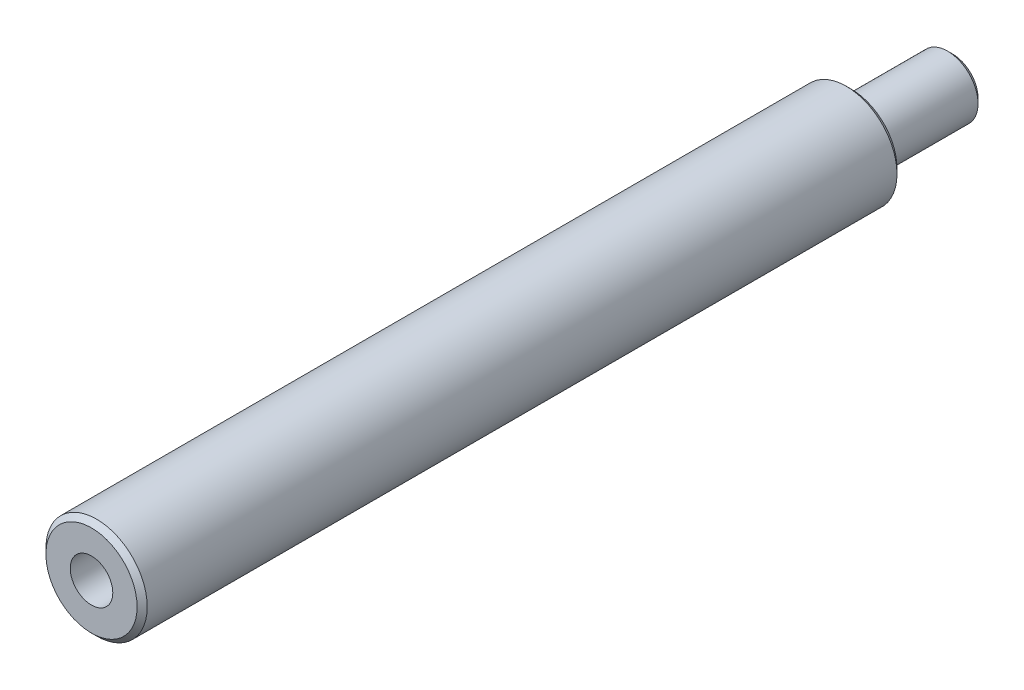
ISO-10303-21;
HEADER;
FILE_DESCRIPTION(('STEP AP214'),'2;1');
FILE_NAME('part.step','',(''),(''),'','','');
FILE_SCHEMA(('AUTOMOTIVE_DESIGN { 1 0 10303 214 1 1 1 1 }'));
ENDSEC;
DATA;
#1=APPLICATION_CONTEXT('core data for automotive mechanical design processes');
#2=APPLICATION_PROTOCOL_DEFINITION('international standard','automotive_design',2000,#1);
#3=PRODUCT_CONTEXT('',#1,'mechanical');
#4=PRODUCT('Part','Part','',(#3));
#5=PRODUCT_RELATED_PRODUCT_CATEGORY('part','',(#4));
#6=PRODUCT_DEFINITION_FORMATION('','',#4);
#7=PRODUCT_DEFINITION_CONTEXT('part definition',#1,'design');
#8=PRODUCT_DEFINITION('design','',#6,#7);
#9=PRODUCT_DEFINITION_SHAPE('','',#8);
#10=(LENGTH_UNIT() NAMED_UNIT(*) SI_UNIT(.MILLI.,.METRE.));
#11=(NAMED_UNIT(*) PLANE_ANGLE_UNIT() SI_UNIT($,.RADIAN.));
#12=(NAMED_UNIT(*) SI_UNIT($,.STERADIAN.) SOLID_ANGLE_UNIT());
#13=UNCERTAINTY_MEASURE_WITH_UNIT(LENGTH_MEASURE(1.E-05),#10,'distance_accuracy_value','');
#14=(GEOMETRIC_REPRESENTATION_CONTEXT(3) GLOBAL_UNCERTAINTY_ASSIGNED_CONTEXT((#13)) GLOBAL_UNIT_ASSIGNED_CONTEXT((#10,
#11,#12)) REPRESENTATION_CONTEXT('',''));
#15=CARTESIAN_POINT('',(0.,0.,0.));
#16=DIRECTION('',(0.,0.,1.));
#17=DIRECTION('',(1.,0.,0.));
#18=AXIS2_PLACEMENT_3D('',#15,#16,#17);
#19=CARTESIAN_POINT('',(0.,0.,75.));
#20=DIRECTION('',(0.,0.,-1.));
#21=DIRECTION('',(-1.,0.,0.));
#22=AXIS2_PLACEMENT_3D('',#19,#20,#21);
#23=CYLINDRICAL_SURFACE('',#22,5.);
#24=CARTESIAN_POINT('',(0.,0.,0.499999999999987));
#25=DIRECTION('',(0.,0.,1.));
#26=DIRECTION('',(1.,0.,0.));
#27=AXIS2_PLACEMENT_3D('',#24,#25,#26);
#28=CIRCLE('',#27,5.);
#29=CARTESIAN_POINT('',(5.,0.,0.499999999999987));
#30=VERTEX_POINT('',#29);
#31=EDGE_CURVE('E71',#30,#30,#28,.T.);
#32=ORIENTED_EDGE('',*,*,#31,.T.);
#33=EDGE_LOOP('',(#32));
#34=FACE_BOUND('',#33,.T.);
#35=CARTESIAN_POINT('',(0.,0.,74.5));
#36=DIRECTION('',(0.,0.,1.));
#37=DIRECTION('',(1.,0.,0.));
#38=AXIS2_PLACEMENT_3D('',#35,#36,#37);
#39=CIRCLE('',#38,5.);
#40=CARTESIAN_POINT('',(5.,0.,74.5));
#41=VERTEX_POINT('',#40);
#42=EDGE_CURVE('E68',#41,#41,#39,.F.);
#43=ORIENTED_EDGE('',*,*,#42,.T.);
#44=EDGE_LOOP('',(#43));
#45=FACE_BOUND('',#44,.T.);
#46=ADVANCED_FACE('F34',(#34,#45),#23,.T.);
#47=CARTESIAN_POINT('',(0.,0.,75.));
#48=DIRECTION('',(0.,0.,1.));
#49=DIRECTION('',(1.,0.,0.));
#50=AXIS2_PLACEMENT_3D('',#47,#48,#49);
#51=PLANE('',#50);
#52=CARTESIAN_POINT('',(0.,0.,75.));
#53=DIRECTION('',(0.,0.,1.));
#54=DIRECTION('',(1.,0.,0.));
#55=AXIS2_PLACEMENT_3D('',#52,#53,#54);
#56=CIRCLE('',#55,4.5);
#57=CARTESIAN_POINT('',(4.5,0.,75.));
#58=VERTEX_POINT('',#57);
#59=EDGE_CURVE('E11',#58,#58,#56,.T.);
#60=ORIENTED_EDGE('',*,*,#59,.T.);
#61=EDGE_LOOP('',(#60));
#62=FACE_BOUND('',#61,.T.);
#63=CARTESIAN_POINT('',(0.,0.,75.));
#64=DIRECTION('',(0.,0.,1.));
#65=DIRECTION('',(1.,0.,0.));
#66=AXIS2_PLACEMENT_3D('',#63,#64,#65);
#67=CIRCLE('',#66,2.1);
#68=CARTESIAN_POINT('',(2.1,0.,75.));
#69=VERTEX_POINT('',#68);
#70=EDGE_CURVE('E55',#69,#69,#67,.T.);
#71=ORIENTED_EDGE('',*,*,#70,.F.);
#72=EDGE_LOOP('',(#71));
#73=FACE_BOUND('',#72,.T.);
#74=ADVANCED_FACE('F87',(#62,#73),#51,.T.);
#75=CARTESIAN_POINT('',(0.,0.,0.));
#76=DIRECTION('',(0.,0.,1.));
#77=DIRECTION('',(1.,0.,0.));
#78=AXIS2_PLACEMENT_3D('',#75,#76,#77);
#79=PLANE('',#78);
#80=CARTESIAN_POINT('',(0.,0.,0.));
#81=DIRECTION('',(0.,0.,1.));
#82=DIRECTION('',(1.,0.,0.));
#83=AXIS2_PLACEMENT_3D('',#80,#81,#82);
#84=CIRCLE('',#83,4.50000000000001);
#85=CARTESIAN_POINT('',(4.50000000000001,0.,0.));
#86=VERTEX_POINT('',#85);
#87=EDGE_CURVE('E41',#86,#86,#84,.F.);
#88=ORIENTED_EDGE('',*,*,#87,.T.);
#89=EDGE_LOOP('',(#88));
#90=FACE_BOUND('',#89,.T.);
#91=CARTESIAN_POINT('',(0.,0.,0.));
#92=DIRECTION('',(0.,0.,-1.));
#93=DIRECTION('',(-1.,0.,0.));
#94=AXIS2_PLACEMENT_3D('',#91,#92,#93);
#95=CIRCLE('',#94,3.);
#96=CARTESIAN_POINT('',(-3.,0.,0.));
#97=VERTEX_POINT('',#96);
#98=EDGE_CURVE('E54',#97,#97,#95,.T.);
#99=ORIENTED_EDGE('',*,*,#98,.F.);
#100=EDGE_LOOP('',(#99));
#101=FACE_BOUND('',#100,.T.);
#102=ADVANCED_FACE('F76',(#90,#101),#79,.F.);
#103=CARTESIAN_POINT('',(0.,0.,-10.));
#104=DIRECTION('',(0.,0.,1.));
#105=DIRECTION('',(1.,0.,0.));
#106=AXIS2_PLACEMENT_3D('',#103,#104,#105);
#107=CYLINDRICAL_SURFACE('',#106,3.);
#108=CARTESIAN_POINT('',(0.,0.,-9.49999999999998));
#109=DIRECTION('',(0.,0.,-1.));
#110=DIRECTION('',(-1.,0.,0.));
#111=AXIS2_PLACEMENT_3D('',#108,#109,#110);
#112=CIRCLE('',#111,3.);
#113=CARTESIAN_POINT('',(-3.,0.,-9.49999999999998));
#114=VERTEX_POINT('',#113);
#115=EDGE_CURVE('E65',#114,#114,#112,.F.);
#116=ORIENTED_EDGE('',*,*,#115,.T.);
#117=EDGE_LOOP('',(#116));
#118=FACE_BOUND('',#117,.T.);
#119=ORIENTED_EDGE('',*,*,#98,.T.);
#120=EDGE_LOOP('',(#119));
#121=FACE_BOUND('',#120,.T.);
#122=ADVANCED_FACE('F110',(#118,#121),#107,.T.);
#123=CARTESIAN_POINT('',(0.,0.,-10.));
#124=DIRECTION('',(0.,0.,-1.));
#125=DIRECTION('',(-1.,0.,0.));
#126=AXIS2_PLACEMENT_3D('',#123,#124,#125);
#127=PLANE('',#126);
#128=CARTESIAN_POINT('',(0.,0.,-10.));
#129=DIRECTION('',(0.,0.,-1.));
#130=DIRECTION('',(-1.,0.,0.));
#131=AXIS2_PLACEMENT_3D('',#128,#129,#130);
#132=CIRCLE('',#131,2.49999999999998);
#133=CARTESIAN_POINT('',(-2.49999999999998,0.,-10.));
#134=VERTEX_POINT('',#133);
#135=EDGE_CURVE('E58',#134,#134,#132,.T.);
#136=ORIENTED_EDGE('',*,*,#135,.T.);
#137=EDGE_LOOP('',(#136));
#138=FACE_BOUND('',#137,.T.);
#139=ADVANCED_FACE('F48',(#138),#127,.T.);
#140=CARTESIAN_POINT('',(0.,0.,65.));
#141=DIRECTION('',(0.,0.,1.));
#142=DIRECTION('',(1.,0.,0.));
#143=AXIS2_PLACEMENT_3D('',#140,#141,#142);
#144=CONICAL_SURFACE('',#143,2.1,1.02974425867665);
#145=CARTESIAN_POINT('',(0.,0.,63.7381927000421));
#146=VERTEX_POINT('',#145);
#147=VERTEX_LOOP('',#146);
#148=FACE_BOUND('',#147,.T.);
#149=CARTESIAN_POINT('',(0.,0.,65.));
#150=DIRECTION('',(0.,0.,1.));
#151=DIRECTION('',(1.,0.,0.));
#152=AXIS2_PLACEMENT_3D('',#149,#150,#151);
#153=CIRCLE('',#152,2.1);
#154=CARTESIAN_POINT('',(2.1,0.,65.));
#155=VERTEX_POINT('',#154);
#156=EDGE_CURVE('E52',#155,#155,#153,.T.);
#157=ORIENTED_EDGE('',*,*,#156,.T.);
#158=EDGE_LOOP('',(#157));
#159=FACE_BOUND('',#158,.T.);
#160=ADVANCED_FACE('F44',(#148,#159),#144,.F.);
#161=CARTESIAN_POINT('',(0.,0.,75.));
#162=DIRECTION('',(0.,0.,1.));
#163=DIRECTION('',(1.,0.,0.));
#164=AXIS2_PLACEMENT_3D('',#161,#162,#163);
#165=CYLINDRICAL_SURFACE('',#164,2.1);
#166=ORIENTED_EDGE('',*,*,#156,.F.);
#167=EDGE_LOOP('',(#166));
#168=FACE_BOUND('',#167,.T.);
#169=ORIENTED_EDGE('',*,*,#70,.T.);
#170=EDGE_LOOP('',(#169));
#171=FACE_BOUND('',#170,.T.);
#172=ADVANCED_FACE('F47',(#168,#171),#165,.F.);
#173=CARTESIAN_POINT('',(0.,0.,-10.));
#174=DIRECTION('',(0.,0.,1.));
#175=DIRECTION('',(1.,0.,0.));
#176=AXIS2_PLACEMENT_3D('',#173,#174,#175);
#177=CONICAL_SURFACE('',#176,2.49999999999998,0.785398163397451);
#178=ORIENTED_EDGE('',*,*,#115,.F.);
#179=EDGE_LOOP('',(#178));
#180=FACE_BOUND('',#179,.T.);
#181=ORIENTED_EDGE('',*,*,#135,.F.);
#182=EDGE_LOOP('',(#181));
#183=FACE_BOUND('',#182,.T.);
#184=ADVANCED_FACE('F82',(#180,#183),#177,.T.);
#185=CARTESIAN_POINT('',(0.,0.,0.499999999999987));
#186=DIRECTION('',(0.,0.,1.));
#187=DIRECTION('',(1.,0.,0.));
#188=AXIS2_PLACEMENT_3D('',#185,#186,#187);
#189=CONICAL_SURFACE('',#188,5.,0.785398163397451);
#190=ORIENTED_EDGE('',*,*,#87,.F.);
#191=EDGE_LOOP('',(#190));
#192=FACE_BOUND('',#191,.T.);
#193=ORIENTED_EDGE('',*,*,#31,.F.);
#194=EDGE_LOOP('',(#193));
#195=FACE_BOUND('',#194,.T.);
#196=ADVANCED_FACE('F79',(#192,#195),#189,.T.);
#197=CARTESIAN_POINT('',(0.,0.,75.));
#198=DIRECTION('',(0.,0.,-1.));
#199=DIRECTION('',(-1.,0.,0.));
#200=AXIS2_PLACEMENT_3D('',#197,#198,#199);
#201=CONICAL_SURFACE('',#200,4.5,0.785398163397444);
#202=ORIENTED_EDGE('',*,*,#42,.F.);
#203=EDGE_LOOP('',(#202));
#204=FACE_BOUND('',#203,.T.);
#205=ORIENTED_EDGE('',*,*,#59,.F.);
#206=EDGE_LOOP('',(#205));
#207=FACE_BOUND('',#206,.T.);
#208=ADVANCED_FACE('F36',(#204,#207),#201,.T.);
#209=CLOSED_SHELL('',(#46,#74,#102,#122,#139,#160,#172,#184,#196,#208));
#210=MANIFOLD_SOLID_BREP('B2',#209);
#211=ADVANCED_BREP_SHAPE_REPRESENTATION('',(#18,#210),#14);
#212=SHAPE_DEFINITION_REPRESENTATION(#9,#211);
ENDSEC;
END-ISO-10303-21;
